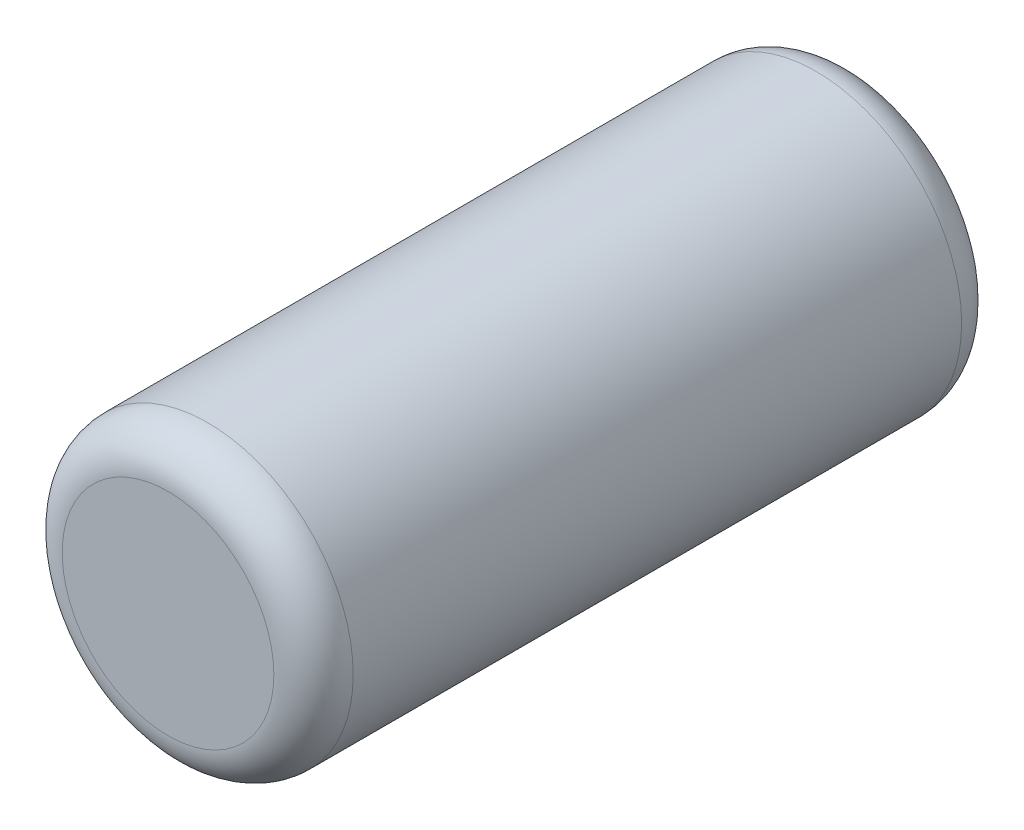
ISO-10303-21;
HEADER;
FILE_DESCRIPTION(('STEP AP214'),'2;1');
FILE_NAME('part.step','',(''),(''),'','','');
FILE_SCHEMA(('AUTOMOTIVE_DESIGN { 1 0 10303 214 1 1 1 1 }'));
ENDSEC;
DATA;
#1=APPLICATION_CONTEXT('core data for automotive mechanical design processes');
#2=APPLICATION_PROTOCOL_DEFINITION('international standard','automotive_design',2000,#1);
#3=PRODUCT_CONTEXT('',#1,'mechanical');
#4=PRODUCT('Part','Part','',(#3));
#5=PRODUCT_RELATED_PRODUCT_CATEGORY('part','',(#4));
#6=PRODUCT_DEFINITION_FORMATION('','',#4);
#7=PRODUCT_DEFINITION_CONTEXT('part definition',#1,'design');
#8=PRODUCT_DEFINITION('design','',#6,#7);
#9=PRODUCT_DEFINITION_SHAPE('','',#8);
#10=(LENGTH_UNIT() NAMED_UNIT(*) SI_UNIT(.MILLI.,.METRE.));
#11=(NAMED_UNIT(*) PLANE_ANGLE_UNIT() SI_UNIT($,.RADIAN.));
#12=(NAMED_UNIT(*) SI_UNIT($,.STERADIAN.) SOLID_ANGLE_UNIT());
#13=UNCERTAINTY_MEASURE_WITH_UNIT(LENGTH_MEASURE(1.E-05),#10,'distance_accuracy_value','');
#14=(GEOMETRIC_REPRESENTATION_CONTEXT(3) GLOBAL_UNCERTAINTY_ASSIGNED_CONTEXT((#13)) GLOBAL_UNIT_ASSIGNED_CONTEXT((#10,
#11,#12)) REPRESENTATION_CONTEXT('',''));
#15=CARTESIAN_POINT('',(0.,0.,0.));
#16=DIRECTION('',(0.,0.,1.));
#17=DIRECTION('',(1.,0.,0.));
#18=AXIS2_PLACEMENT_3D('',#15,#16,#17);
#19=CARTESIAN_POINT('',(0.,0.,13.));
#20=DIRECTION('',(0.,0.,-1.));
#21=DIRECTION('',(-1.,0.,0.));
#22=AXIS2_PLACEMENT_3D('',#19,#20,#21);
#23=CYLINDRICAL_SURFACE('',#22,5.5);
#24=CARTESIAN_POINT('',(0.,0.,-11.5));
#25=DIRECTION('',(0.,0.,1.));
#26=DIRECTION('',(1.,0.,0.));
#27=AXIS2_PLACEMENT_3D('',#24,#25,#26);
#28=CIRCLE('',#27,5.5);
#29=CARTESIAN_POINT('',(5.5,0.,-11.5));
#30=VERTEX_POINT('',#29);
#31=EDGE_CURVE('E50',#30,#30,#28,.T.);
#32=ORIENTED_EDGE('',*,*,#31,.T.);
#33=EDGE_LOOP('',(#32));
#34=FACE_BOUND('',#33,.T.);
#35=CARTESIAN_POINT('',(0.,0.,11.5));
#36=DIRECTION('',(0.,0.,1.));
#37=DIRECTION('',(1.,0.,0.));
#38=AXIS2_PLACEMENT_3D('',#35,#36,#37);
#39=CIRCLE('',#38,5.5);
#40=CARTESIAN_POINT('',(5.5,0.,11.5));
#41=VERTEX_POINT('',#40);
#42=EDGE_CURVE('E55',#41,#41,#39,.F.);
#43=ORIENTED_EDGE('',*,*,#42,.T.);
#44=EDGE_LOOP('',(#43));
#45=FACE_BOUND('',#44,.T.);
#46=ADVANCED_FACE('F37',(#34,#45),#23,.T.);
#47=CARTESIAN_POINT('',(0.,0.,13.));
#48=DIRECTION('',(0.,0.,1.));
#49=DIRECTION('',(1.,0.,0.));
#50=AXIS2_PLACEMENT_3D('',#47,#48,#49);
#51=PLANE('',#50);
#52=CARTESIAN_POINT('',(0.,0.,13.));
#53=DIRECTION('',(0.,0.,1.));
#54=DIRECTION('',(1.,0.,0.));
#55=AXIS2_PLACEMENT_3D('',#52,#53,#54);
#56=CIRCLE('',#55,4.);
#57=CARTESIAN_POINT('',(4.,0.,13.));
#58=VERTEX_POINT('',#57);
#59=EDGE_CURVE('E10',#58,#58,#56,.T.);
#60=ORIENTED_EDGE('',*,*,#59,.T.);
#61=EDGE_LOOP('',(#60));
#62=FACE_BOUND('',#61,.T.);
#63=ADVANCED_FACE('F72',(#62),#51,.T.);
#64=CARTESIAN_POINT('',(0.,0.,-13.));
#65=DIRECTION('',(0.,0.,1.));
#66=DIRECTION('',(1.,0.,0.));
#67=AXIS2_PLACEMENT_3D('',#64,#65,#66);
#68=PLANE('',#67);
#69=CARTESIAN_POINT('',(0.,0.,-13.));
#70=DIRECTION('',(0.,0.,1.));
#71=DIRECTION('',(1.,0.,0.));
#72=AXIS2_PLACEMENT_3D('',#69,#70,#71);
#73=CIRCLE('',#72,4.);
#74=CARTESIAN_POINT('',(4.,0.,-13.));
#75=VERTEX_POINT('',#74);
#76=EDGE_CURVE('E45',#75,#75,#73,.F.);
#77=ORIENTED_EDGE('',*,*,#76,.T.);
#78=EDGE_LOOP('',(#77));
#79=FACE_BOUND('',#78,.T.);
#80=ADVANCED_FACE('F69',(#79),#68,.F.);
#81=CARTESIAN_POINT('',(0.,0.,-11.5));
#82=DIRECTION('',(0.,0.,1.));
#83=DIRECTION('',(1.,0.,0.));
#84=AXIS2_PLACEMENT_3D('',#81,#82,#83);
#85=TOROIDAL_SURFACE('',#84,4.,1.5);
#86=ORIENTED_EDGE('',*,*,#76,.F.);
#87=EDGE_LOOP('',(#86));
#88=FACE_BOUND('',#87,.T.);
#89=ORIENTED_EDGE('',*,*,#31,.F.);
#90=EDGE_LOOP('',(#89));
#91=FACE_BOUND('',#90,.T.);
#92=ADVANCED_FACE('F65',(#88,#91),#85,.T.);
#93=CARTESIAN_POINT('',(0.,0.,11.5));
#94=DIRECTION('',(0.,0.,1.));
#95=DIRECTION('',(1.,0.,0.));
#96=AXIS2_PLACEMENT_3D('',#93,#94,#95);
#97=TOROIDAL_SURFACE('',#96,4.,1.5);
#98=ORIENTED_EDGE('',*,*,#42,.F.);
#99=EDGE_LOOP('',(#98));
#100=FACE_BOUND('',#99,.T.);
#101=ORIENTED_EDGE('',*,*,#59,.F.);
#102=EDGE_LOOP('',(#101));
#103=FACE_BOUND('',#102,.T.);
#104=ADVANCED_FACE('F39',(#100,#103),#97,.T.);
#105=CLOSED_SHELL('',(#46,#63,#80,#92,#104));
#106=MANIFOLD_SOLID_BREP('B2',#105);
#107=ADVANCED_BREP_SHAPE_REPRESENTATION('',(#18,#106),#14);
#108=SHAPE_DEFINITION_REPRESENTATION(#9,#107);
ENDSEC;
END-ISO-10303-21;
